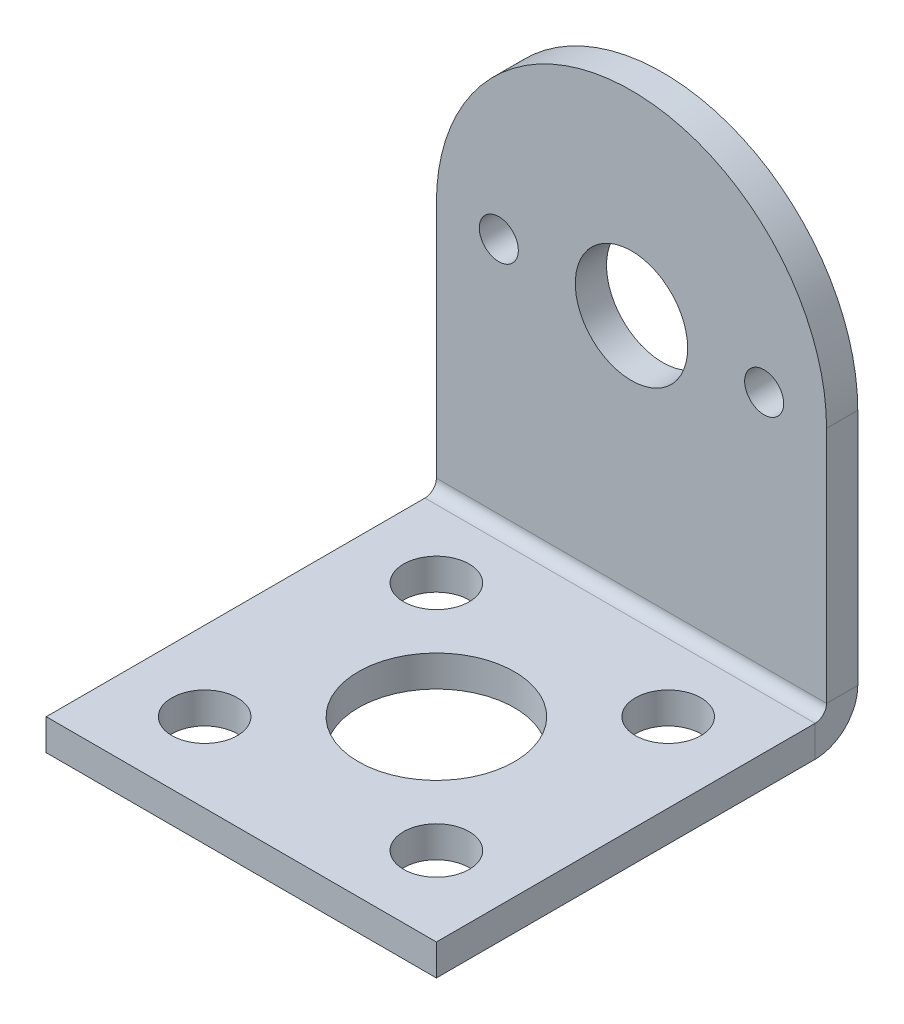
ISO-10303-21;
HEADER;
FILE_DESCRIPTION(('STEP AP214'),'2;1');
FILE_NAME('part.step','',(''),(''),'','','');
FILE_SCHEMA(('AUTOMOTIVE_DESIGN { 1 0 10303 214 1 1 1 1 }'));
ENDSEC;
DATA;
#1=APPLICATION_CONTEXT('core data for automotive mechanical design processes');
#2=APPLICATION_PROTOCOL_DEFINITION('international standard','automotive_design',2000,#1);
#3=PRODUCT_CONTEXT('',#1,'mechanical');
#4=PRODUCT('Part','Part','',(#3));
#5=PRODUCT_RELATED_PRODUCT_CATEGORY('part','',(#4));
#6=PRODUCT_DEFINITION_FORMATION('','',#4);
#7=PRODUCT_DEFINITION_CONTEXT('part definition',#1,'design');
#8=PRODUCT_DEFINITION('design','',#6,#7);
#9=PRODUCT_DEFINITION_SHAPE('','',#8);
#10=(LENGTH_UNIT() NAMED_UNIT(*) SI_UNIT(.MILLI.,.METRE.));
#11=(NAMED_UNIT(*) PLANE_ANGLE_UNIT() SI_UNIT($,.RADIAN.));
#12=(NAMED_UNIT(*) SI_UNIT($,.STERADIAN.) SOLID_ANGLE_UNIT());
#13=UNCERTAINTY_MEASURE_WITH_UNIT(LENGTH_MEASURE(1.E-05),#10,'distance_accuracy_value','');
#14=(GEOMETRIC_REPRESENTATION_CONTEXT(3) GLOBAL_UNCERTAINTY_ASSIGNED_CONTEXT((#13)) GLOBAL_UNIT_ASSIGNED_CONTEXT((#10,
#11,#12)) REPRESENTATION_CONTEXT('',''));
#15=CARTESIAN_POINT('',(0.,0.,0.));
#16=DIRECTION('',(0.,0.,1.));
#17=DIRECTION('',(1.,0.,0.));
#18=AXIS2_PLACEMENT_3D('',#15,#16,#17);
#19=CARTESIAN_POINT('',(12.5,0.,-2.));
#20=DIRECTION('',(1.,0.,0.));
#21=DIRECTION('',(0.,0.,-1.));
#22=AXIS2_PLACEMENT_3D('',#19,#20,#21);
#23=PLANE('',#22);
#24=DIRECTION('',(0.,1.,0.));
#25=VECTOR('',#24,1.);
#26=CARTESIAN_POINT('',(12.5,0.,0.));
#27=LINE('',#26,#25);
#28=CARTESIAN_POINT('',(12.5,2.7366,0.));
#29=VERTEX_POINT('',#28);
#30=CARTESIAN_POINT('',(12.5,18.,0.));
#31=VERTEX_POINT('',#30);
#32=EDGE_CURVE('E119',#29,#31,#27,.T.);
#33=ORIENTED_EDGE('',*,*,#32,.F.);
#34=DIRECTION('',(0.,0.,-1.));
#35=VECTOR('',#34,1.);
#36=CARTESIAN_POINT('',(12.5,2.7366,0.));
#37=LINE('',#36,#35);
#38=CARTESIAN_POINT('',(12.5,2.7366,-2.));
#39=VERTEX_POINT('',#38);
#40=EDGE_CURVE('E150',#29,#39,#37,.T.);
#41=ORIENTED_EDGE('',*,*,#40,.T.);
#42=DIRECTION('',(0.,1.,0.));
#43=VECTOR('',#42,1.);
#44=CARTESIAN_POINT('',(12.5,0.,-2.));
#45=LINE('',#44,#43);
#46=CARTESIAN_POINT('',(12.5,18.,-2.));
#47=VERTEX_POINT('',#46);
#48=EDGE_CURVE('E127',#39,#47,#45,.T.);
#49=ORIENTED_EDGE('',*,*,#48,.T.);
#50=DIRECTION('',(0.,0.,1.));
#51=VECTOR('',#50,1.);
#52=CARTESIAN_POINT('',(12.5,18.,-2.));
#53=LINE('',#52,#51);
#54=EDGE_CURVE('E75',#47,#31,#53,.T.);
#55=ORIENTED_EDGE('',*,*,#54,.T.);
#56=EDGE_LOOP('',(#33,#41,#49,#55));
#57=FACE_BOUND('',#56,.T.);
#58=ADVANCED_FACE('F71',(#57),#23,.T.);
#59=CARTESIAN_POINT('',(0.,18.,-2.));
#60=DIRECTION('',(0.,0.,-1.));
#61=DIRECTION('',(-1.,0.,0.));
#62=AXIS2_PLACEMENT_3D('',#59,#60,#61);
#63=PLANE('',#62);
#64=CARTESIAN_POINT('',(8.5,18.,-2.));
#65=DIRECTION('',(0.,0.,1.));
#66=DIRECTION('',(-1.,0.,0.));
#67=AXIS2_PLACEMENT_3D('',#64,#65,#66);
#68=CIRCLE('',#67,1.25);
#69=CARTESIAN_POINT('',(7.25,18.,-2.));
#70=VERTEX_POINT('',#69);
#71=EDGE_CURVE('E142',#70,#70,#68,.T.);
#72=ORIENTED_EDGE('',*,*,#71,.T.);
#73=EDGE_LOOP('',(#72));
#74=FACE_BOUND('',#73,.T.);
#75=CARTESIAN_POINT('',(-8.5,18.,-2.));
#76=DIRECTION('',(0.,0.,1.));
#77=DIRECTION('',(1.,0.,0.));
#78=AXIS2_PLACEMENT_3D('',#75,#76,#77);
#79=CIRCLE('',#78,1.25);
#80=CARTESIAN_POINT('',(-7.25,18.,-2.));
#81=VERTEX_POINT('',#80);
#82=EDGE_CURVE('E136',#81,#81,#79,.T.);
#83=ORIENTED_EDGE('',*,*,#82,.T.);
#84=EDGE_LOOP('',(#83));
#85=FACE_BOUND('',#84,.T.);
#86=CARTESIAN_POINT('',(0.,18.,-2.));
#87=DIRECTION('',(0.,0.,1.));
#88=DIRECTION('',(1.,0.,0.));
#89=AXIS2_PLACEMENT_3D('',#86,#87,#88);
#90=CIRCLE('',#89,3.6);
#91=CARTESIAN_POINT('',(3.6,18.,-2.));
#92=VERTEX_POINT('',#91);
#93=EDGE_CURVE('E120',#92,#92,#90,.T.);
#94=ORIENTED_EDGE('',*,*,#93,.T.);
#95=EDGE_LOOP('',(#94));
#96=FACE_BOUND('',#95,.T.);
#97=ORIENTED_EDGE('',*,*,#48,.F.);
#98=DIRECTION('',(1.,0.,0.));
#99=VECTOR('',#98,1.);
#100=CARTESIAN_POINT('',(12.5,2.7366,-2.));
#101=LINE('',#100,#99);
#102=CARTESIAN_POINT('',(-12.5,2.73660000000001,-2.));
#103=VERTEX_POINT('',#102);
#104=EDGE_CURVE('E167',#39,#103,#101,.F.);
#105=ORIENTED_EDGE('',*,*,#104,.T.);
#106=DIRECTION('',(0.,-1.,0.));
#107=VECTOR('',#106,1.);
#108=CARTESIAN_POINT('',(-12.5,0.,-2.));
#109=LINE('',#108,#107);
#110=CARTESIAN_POINT('',(-12.5,18.,-2.));
#111=VERTEX_POINT('',#110);
#112=EDGE_CURVE('E125',#111,#103,#109,.T.);
#113=ORIENTED_EDGE('',*,*,#112,.F.);
#114=CARTESIAN_POINT('',(0.,18.,-2.));
#115=DIRECTION('',(0.,0.,1.));
#116=DIRECTION('',(-1.,0.,0.));
#117=AXIS2_PLACEMENT_3D('',#114,#115,#116);
#118=CIRCLE('',#117,12.5);
#119=EDGE_CURVE('E111',#47,#111,#118,.T.);
#120=ORIENTED_EDGE('',*,*,#119,.F.);
#121=EDGE_LOOP('',(#97,#105,#113,#120));
#122=FACE_BOUND('',#121,.T.);
#123=ADVANCED_FACE('F287',(#74,#85,#96,#122),#63,.T.);
#124=CARTESIAN_POINT('',(0.,18.,0.));
#125=DIRECTION('',(0.,0.,-1.));
#126=DIRECTION('',(-1.,0.,0.));
#127=AXIS2_PLACEMENT_3D('',#124,#125,#126);
#128=PLANE('',#127);
#129=CARTESIAN_POINT('',(0.,18.,0.));
#130=DIRECTION('',(0.,0.,1.));
#131=DIRECTION('',(1.,0.,0.));
#132=AXIS2_PLACEMENT_3D('',#129,#130,#131);
#133=CIRCLE('',#132,3.6);
#134=CARTESIAN_POINT('',(3.6,18.,0.));
#135=VERTEX_POINT('',#134);
#136=EDGE_CURVE('E133',#135,#135,#133,.T.);
#137=ORIENTED_EDGE('',*,*,#136,.F.);
#138=EDGE_LOOP('',(#137));
#139=FACE_BOUND('',#138,.T.);
#140=CARTESIAN_POINT('',(-8.5,18.,0.));
#141=DIRECTION('',(0.,0.,1.));
#142=DIRECTION('',(1.,0.,0.));
#143=AXIS2_PLACEMENT_3D('',#140,#141,#142);
#144=CIRCLE('',#143,1.25);
#145=CARTESIAN_POINT('',(-7.25,18.,0.));
#146=VERTEX_POINT('',#145);
#147=EDGE_CURVE('E139',#146,#146,#144,.T.);
#148=ORIENTED_EDGE('',*,*,#147,.F.);
#149=EDGE_LOOP('',(#148));
#150=FACE_BOUND('',#149,.T.);
#151=CARTESIAN_POINT('',(8.5,18.,0.));
#152=DIRECTION('',(0.,0.,1.));
#153=DIRECTION('',(-1.,0.,0.));
#154=AXIS2_PLACEMENT_3D('',#151,#152,#153);
#155=CIRCLE('',#154,1.25);
#156=CARTESIAN_POINT('',(7.25,18.,0.));
#157=VERTEX_POINT('',#156);
#158=EDGE_CURVE('E145',#157,#157,#155,.T.);
#159=ORIENTED_EDGE('',*,*,#158,.F.);
#160=EDGE_LOOP('',(#159));
#161=FACE_BOUND('',#160,.T.);
#162=DIRECTION('',(1.,0.,0.));
#163=VECTOR('',#162,1.);
#164=CARTESIAN_POINT('',(12.5,2.7366,0.));
#165=LINE('',#164,#163);
#166=CARTESIAN_POINT('',(-12.5,2.7366,0.));
#167=VERTEX_POINT('',#166);
#168=EDGE_CURVE('E157',#29,#167,#165,.F.);
#169=ORIENTED_EDGE('',*,*,#168,.F.);
#170=ORIENTED_EDGE('',*,*,#32,.T.);
#171=CARTESIAN_POINT('',(0.,18.,0.));
#172=DIRECTION('',(0.,0.,1.));
#173=DIRECTION('',(-1.,0.,0.));
#174=AXIS2_PLACEMENT_3D('',#171,#172,#173);
#175=CIRCLE('',#174,12.5);
#176=CARTESIAN_POINT('',(-12.5,18.,0.));
#177=VERTEX_POINT('',#176);
#178=EDGE_CURVE('E109',#31,#177,#175,.T.);
#179=ORIENTED_EDGE('',*,*,#178,.T.);
#180=DIRECTION('',(0.,-1.,0.));
#181=VECTOR('',#180,1.);
#182=CARTESIAN_POINT('',(-12.5,0.,0.));
#183=LINE('',#182,#181);
#184=EDGE_CURVE('E114',#177,#167,#183,.T.);
#185=ORIENTED_EDGE('',*,*,#184,.T.);
#186=EDGE_LOOP('',(#169,#170,#179,#185));
#187=FACE_BOUND('',#186,.T.);
#188=ADVANCED_FACE('F122',(#139,#150,#161,#187),#128,.F.);
#189=CARTESIAN_POINT('',(-12.5,0.,-2.));
#190=DIRECTION('',(-1.,0.,0.));
#191=DIRECTION('',(0.,0.,1.));
#192=AXIS2_PLACEMENT_3D('',#189,#190,#191);
#193=PLANE('',#192);
#194=DIRECTION('',(0.,0.,-1.));
#195=VECTOR('',#194,1.);
#196=CARTESIAN_POINT('',(-12.5,2.7366,0.));
#197=LINE('',#196,#195);
#198=EDGE_CURVE('E116',#167,#103,#197,.T.);
#199=ORIENTED_EDGE('',*,*,#198,.F.);
#200=ORIENTED_EDGE('',*,*,#184,.F.);
#201=DIRECTION('',(0.,0.,1.));
#202=VECTOR('',#201,1.);
#203=CARTESIAN_POINT('',(-12.5,18.,-2.));
#204=LINE('',#203,#202);
#205=EDGE_CURVE('E13',#111,#177,#204,.T.);
#206=ORIENTED_EDGE('',*,*,#205,.F.);
#207=ORIENTED_EDGE('',*,*,#112,.T.);
#208=EDGE_LOOP('',(#199,#200,#206,#207));
#209=FACE_BOUND('',#208,.T.);
#210=ADVANCED_FACE('F73',(#209),#193,.T.);
#211=CARTESIAN_POINT('',(0.,18.,-2.));
#212=DIRECTION('',(0.,0.,1.));
#213=DIRECTION('',(1.,0.,0.));
#214=AXIS2_PLACEMENT_3D('',#211,#212,#213);
#215=CYLINDRICAL_SURFACE('',#214,12.5);
#216=ORIENTED_EDGE('',*,*,#178,.F.);
#217=ORIENTED_EDGE('',*,*,#54,.F.);
#218=ORIENTED_EDGE('',*,*,#119,.T.);
#219=ORIENTED_EDGE('',*,*,#205,.T.);
#220=EDGE_LOOP('',(#216,#217,#218,#219));
#221=FACE_BOUND('',#220,.T.);
#222=ADVANCED_FACE('F106',(#221),#215,.T.);
#223=CARTESIAN_POINT('',(0.,18.,-2.));
#224=DIRECTION('',(0.,0.,1.));
#225=DIRECTION('',(1.,0.,0.));
#226=AXIS2_PLACEMENT_3D('',#223,#224,#225);
#227=CYLINDRICAL_SURFACE('',#226,3.6);
#228=ORIENTED_EDGE('',*,*,#93,.F.);
#229=EDGE_LOOP('',(#228));
#230=FACE_BOUND('',#229,.T.);
#231=ORIENTED_EDGE('',*,*,#136,.T.);
#232=EDGE_LOOP('',(#231));
#233=FACE_BOUND('',#232,.T.);
#234=ADVANCED_FACE('F311',(#230,#233),#227,.F.);
#235=CARTESIAN_POINT('',(-8.5,18.,-2.));
#236=DIRECTION('',(0.,0.,1.));
#237=DIRECTION('',(1.,0.,0.));
#238=AXIS2_PLACEMENT_3D('',#235,#236,#237);
#239=CYLINDRICAL_SURFACE('',#238,1.25);
#240=ORIENTED_EDGE('',*,*,#82,.F.);
#241=EDGE_LOOP('',(#240));
#242=FACE_BOUND('',#241,.T.);
#243=ORIENTED_EDGE('',*,*,#147,.T.);
#244=EDGE_LOOP('',(#243));
#245=FACE_BOUND('',#244,.T.);
#246=ADVANCED_FACE('F298',(#242,#245),#239,.F.);
#247=CARTESIAN_POINT('',(8.5,18.,-2.));
#248=DIRECTION('',(0.,0.,1.));
#249=DIRECTION('',(1.,0.,0.));
#250=AXIS2_PLACEMENT_3D('',#247,#248,#249);
#251=CYLINDRICAL_SURFACE('',#250,1.25);
#252=ORIENTED_EDGE('',*,*,#71,.F.);
#253=EDGE_LOOP('',(#252));
#254=FACE_BOUND('',#253,.T.);
#255=ORIENTED_EDGE('',*,*,#158,.T.);
#256=EDGE_LOOP('',(#255));
#257=FACE_BOUND('',#256,.T.);
#258=ADVANCED_FACE('F291',(#254,#257),#251,.F.);
#259=CARTESIAN_POINT('',(-12.5,2.7366,0.7366));
#260=DIRECTION('',(-1.,0.,0.));
#261=DIRECTION('',(0.,0.,1.));
#262=AXIS2_PLACEMENT_3D('',#259,#260,#261);
#263=PLANE('',#262);
#264=DIRECTION('',(0.,1.,0.));
#265=VECTOR('',#264,1.);
#266=CARTESIAN_POINT('',(-12.5,0.,0.73659999999999));
#267=LINE('',#266,#265);
#268=CARTESIAN_POINT('',(-12.5,2.,0.736599999999997));
#269=VERTEX_POINT('',#268);
#270=CARTESIAN_POINT('',(-12.5,0.,0.73659999999999));
#271=VERTEX_POINT('',#270);
#272=EDGE_CURVE('E171',#269,#271,#267,.F.);
#273=ORIENTED_EDGE('',*,*,#272,.F.);
#274=CARTESIAN_POINT('',(-12.5,2.7366,0.7366));
#275=DIRECTION('',(1.,0.,0.));
#276=DIRECTION('',(0.,0.,-1.));
#277=AXIS2_PLACEMENT_3D('',#274,#275,#276);
#278=CIRCLE('',#277,0.7366);
#279=EDGE_CURVE('E161',#167,#269,#278,.F.);
#280=ORIENTED_EDGE('',*,*,#279,.F.);
#281=ORIENTED_EDGE('',*,*,#198,.T.);
#282=CARTESIAN_POINT('',(-12.5,2.7366,0.7366));
#283=DIRECTION('',(1.,0.,0.));
#284=DIRECTION('',(0.,0.,-1.));
#285=AXIS2_PLACEMENT_3D('',#282,#283,#284);
#286=CIRCLE('',#285,2.7366);
#287=EDGE_CURVE('E86',#103,#271,#286,.F.);
#288=ORIENTED_EDGE('',*,*,#287,.T.);
#289=EDGE_LOOP('',(#273,#280,#281,#288));
#290=FACE_BOUND('',#289,.T.);
#291=ADVANCED_FACE('F289',(#290),#263,.T.);
#292=CARTESIAN_POINT('',(12.5,2.7366,0.7366));
#293=DIRECTION('',(-1.,0.,0.));
#294=DIRECTION('',(0.,0.,1.));
#295=AXIS2_PLACEMENT_3D('',#292,#293,#294);
#296=PLANE('',#295);
#297=CARTESIAN_POINT('',(12.5,2.7366,0.7366));
#298=DIRECTION('',(1.,0.,0.));
#299=DIRECTION('',(0.,0.,-1.));
#300=AXIS2_PLACEMENT_3D('',#297,#298,#299);
#301=CIRCLE('',#300,0.7366);
#302=CARTESIAN_POINT('',(12.5,2.,0.736599999999997));
#303=VERTEX_POINT('',#302);
#304=EDGE_CURVE('E154',#303,#29,#301,.T.);
#305=ORIENTED_EDGE('',*,*,#304,.F.);
#306=DIRECTION('',(0.,1.,0.));
#307=VECTOR('',#306,1.);
#308=CARTESIAN_POINT('',(12.5,2.,0.736599999999997));
#309=LINE('',#308,#307);
#310=CARTESIAN_POINT('',(12.5,0.,0.73659999999999));
#311=VERTEX_POINT('',#310);
#312=EDGE_CURVE('E177',#303,#311,#309,.F.);
#313=ORIENTED_EDGE('',*,*,#312,.T.);
#314=CARTESIAN_POINT('',(12.5,2.7366,0.7366));
#315=DIRECTION('',(1.,0.,0.));
#316=DIRECTION('',(0.,0.,-1.));
#317=AXIS2_PLACEMENT_3D('',#314,#315,#316);
#318=CIRCLE('',#317,2.7366);
#319=EDGE_CURVE('E164',#311,#39,#318,.T.);
#320=ORIENTED_EDGE('',*,*,#319,.T.);
#321=ORIENTED_EDGE('',*,*,#40,.F.);
#322=EDGE_LOOP('',(#305,#313,#320,#321));
#323=FACE_BOUND('',#322,.T.);
#324=ADVANCED_FACE('F281',(#323),#296,.F.);
#325=CARTESIAN_POINT('',(12.5,2.7366,0.7366));
#326=DIRECTION('',(1.,0.,0.));
#327=DIRECTION('',(0.,-1.,0.));
#328=AXIS2_PLACEMENT_3D('',#325,#326,#327);
#329=CYLINDRICAL_SURFACE('',#328,2.7366);
#330=ORIENTED_EDGE('',*,*,#104,.F.);
#331=ORIENTED_EDGE('',*,*,#319,.F.);
#332=DIRECTION('',(1.,0.,0.));
#333=VECTOR('',#332,1.);
#334=CARTESIAN_POINT('',(-12.5,0.,0.73659999999999));
#335=LINE('',#334,#333);
#336=EDGE_CURVE('E180',#311,#271,#335,.F.);
#337=ORIENTED_EDGE('',*,*,#336,.T.);
#338=ORIENTED_EDGE('',*,*,#287,.F.);
#339=EDGE_LOOP('',(#330,#331,#337,#338));
#340=FACE_BOUND('',#339,.T.);
#341=ADVANCED_FACE('F288',(#340),#329,.T.);
#342=CARTESIAN_POINT('',(12.5,2.7366,0.7366));
#343=DIRECTION('',(1.,0.,0.));
#344=DIRECTION('',(0.,-1.,0.));
#345=AXIS2_PLACEMENT_3D('',#342,#343,#344);
#346=CYLINDRICAL_SURFACE('',#345,0.7366);
#347=ORIENTED_EDGE('',*,*,#168,.T.);
#348=ORIENTED_EDGE('',*,*,#279,.T.);
#349=DIRECTION('',(1.,0.,0.));
#350=VECTOR('',#349,1.);
#351=CARTESIAN_POINT('',(-12.5,2.,0.736599999999997));
#352=LINE('',#351,#350);
#353=EDGE_CURVE('E174',#269,#303,#352,.T.);
#354=ORIENTED_EDGE('',*,*,#353,.T.);
#355=ORIENTED_EDGE('',*,*,#304,.T.);
#356=EDGE_LOOP('',(#347,#348,#354,#355));
#357=FACE_BOUND('',#356,.T.);
#358=ADVANCED_FACE('F283',(#357),#346,.F.);
#359=CARTESIAN_POINT('',(0.,0.,0.));
#360=DIRECTION('',(0.,1.,0.));
#361=DIRECTION('',(0.,0.,1.));
#362=AXIS2_PLACEMENT_3D('',#359,#360,#361);
#363=PLANE('',#362);
#364=CARTESIAN_POINT('',(7.425,0.,19.925));
#365=DIRECTION('',(0.,1.,0.));
#366=DIRECTION('',(0.,0.,1.));
#367=AXIS2_PLACEMENT_3D('',#364,#365,#366);
#368=CIRCLE('',#367,2.1);
#369=CARTESIAN_POINT('',(7.425,0.,22.025));
#370=VERTEX_POINT('',#369);
#371=EDGE_CURVE('E185',#370,#370,#368,.F.);
#372=ORIENTED_EDGE('',*,*,#371,.F.);
#373=EDGE_LOOP('',(#372));
#374=FACE_BOUND('',#373,.T.);
#375=CARTESIAN_POINT('',(7.425,0.,5.075));
#376=DIRECTION('',(0.,1.,0.));
#377=DIRECTION('',(0.,0.,1.));
#378=AXIS2_PLACEMENT_3D('',#375,#376,#377);
#379=CIRCLE('',#378,2.1);
#380=CARTESIAN_POINT('',(7.425,0.,7.175));
#381=VERTEX_POINT('',#380);
#382=EDGE_CURVE('E191',#381,#381,#379,.F.);
#383=ORIENTED_EDGE('',*,*,#382,.F.);
#384=EDGE_LOOP('',(#383));
#385=FACE_BOUND('',#384,.T.);
#386=CARTESIAN_POINT('',(-7.425,0.,19.925));
#387=DIRECTION('',(0.,1.,0.));
#388=DIRECTION('',(0.,0.,1.));
#389=AXIS2_PLACEMENT_3D('',#386,#387,#388);
#390=CIRCLE('',#389,2.1);
#391=CARTESIAN_POINT('',(-7.425,0.,22.025));
#392=VERTEX_POINT('',#391);
#393=EDGE_CURVE('E197',#392,#392,#390,.F.);
#394=ORIENTED_EDGE('',*,*,#393,.F.);
#395=EDGE_LOOP('',(#394));
#396=FACE_BOUND('',#395,.T.);
#397=CARTESIAN_POINT('',(-7.425,0.,5.07499999999999));
#398=DIRECTION('',(0.,1.,0.));
#399=DIRECTION('',(0.,0.,1.));
#400=AXIS2_PLACEMENT_3D('',#397,#398,#399);
#401=CIRCLE('',#400,2.1);
#402=CARTESIAN_POINT('',(-7.425,0.,7.17499999999999));
#403=VERTEX_POINT('',#402);
#404=EDGE_CURVE('E203',#403,#403,#401,.F.);
#405=ORIENTED_EDGE('',*,*,#404,.F.);
#406=EDGE_LOOP('',(#405));
#407=FACE_BOUND('',#406,.T.);
#408=CARTESIAN_POINT('',(0.,0.,12.5));
#409=DIRECTION('',(0.,1.,0.));
#410=DIRECTION('',(0.,0.,1.));
#411=AXIS2_PLACEMENT_3D('',#408,#409,#410);
#412=CIRCLE('',#411,5.);
#413=CARTESIAN_POINT('',(0.,0.,17.5));
#414=VERTEX_POINT('',#413);
#415=EDGE_CURVE('E209',#414,#414,#412,.F.);
#416=ORIENTED_EDGE('',*,*,#415,.F.);
#417=EDGE_LOOP('',(#416));
#418=FACE_BOUND('',#417,.T.);
#419=ORIENTED_EDGE('',*,*,#336,.F.);
#420=DIRECTION('',(0.,0.,1.));
#421=VECTOR('',#420,1.);
#422=CARTESIAN_POINT('',(12.5,0.,0.));
#423=LINE('',#422,#421);
#424=CARTESIAN_POINT('',(12.5,0.,25.));
#425=VERTEX_POINT('',#424);
#426=EDGE_CURVE('E224',#311,#425,#423,.T.);
#427=ORIENTED_EDGE('',*,*,#426,.T.);
#428=DIRECTION('',(-1.,0.,0.));
#429=VECTOR('',#428,1.);
#430=CARTESIAN_POINT('',(0.,0.,25.));
#431=LINE('',#430,#429);
#432=CARTESIAN_POINT('',(-12.5,0.,25.));
#433=VERTEX_POINT('',#432);
#434=EDGE_CURVE('E227',#425,#433,#431,.T.);
#435=ORIENTED_EDGE('',*,*,#434,.T.);
#436=DIRECTION('',(0.,0.,-1.));
#437=VECTOR('',#436,1.);
#438=CARTESIAN_POINT('',(-12.5,0.,0.));
#439=LINE('',#438,#437);
#440=EDGE_CURVE('E221',#433,#271,#439,.T.);
#441=ORIENTED_EDGE('',*,*,#440,.T.);
#442=EDGE_LOOP('',(#419,#427,#435,#441));
#443=FACE_BOUND('',#442,.T.);
#444=ADVANCED_FACE('F276',(#374,#385,#396,#407,#418,#443),#363,.F.);
#445=CARTESIAN_POINT('',(0.,2.,0.));
#446=DIRECTION('',(0.,1.,0.));
#447=DIRECTION('',(0.,0.,1.));
#448=AXIS2_PLACEMENT_3D('',#445,#446,#447);
#449=PLANE('',#448);
#450=CARTESIAN_POINT('',(7.425,1.99999999999998,5.075));
#451=DIRECTION('',(0.,1.,0.));
#452=DIRECTION('',(0.,0.,1.));
#453=AXIS2_PLACEMENT_3D('',#450,#451,#452);
#454=CIRCLE('',#453,2.1);
#455=CARTESIAN_POINT('',(7.425,1.99999999999997,7.175));
#456=VERTEX_POINT('',#455);
#457=EDGE_CURVE('E188',#456,#456,#454,.F.);
#458=ORIENTED_EDGE('',*,*,#457,.T.);
#459=EDGE_LOOP('',(#458));
#460=FACE_BOUND('',#459,.T.);
#461=CARTESIAN_POINT('',(-7.425,1.99999999999998,5.075));
#462=DIRECTION('',(0.,1.,0.));
#463=DIRECTION('',(0.,0.,1.));
#464=AXIS2_PLACEMENT_3D('',#461,#462,#463);
#465=CIRCLE('',#464,2.1);
#466=CARTESIAN_POINT('',(-7.425,1.99999999999997,7.175));
#467=VERTEX_POINT('',#466);
#468=EDGE_CURVE('E200',#467,#467,#465,.F.);
#469=ORIENTED_EDGE('',*,*,#468,.T.);
#470=EDGE_LOOP('',(#469));
#471=FACE_BOUND('',#470,.T.);
#472=CARTESIAN_POINT('',(0.,1.99999999999996,12.5));
#473=DIRECTION('',(0.,1.,0.));
#474=DIRECTION('',(0.,0.,1.));
#475=AXIS2_PLACEMENT_3D('',#472,#473,#474);
#476=CIRCLE('',#475,5.);
#477=CARTESIAN_POINT('',(0.,1.99999999999994,17.5));
#478=VERTEX_POINT('',#477);
#479=EDGE_CURVE('E206',#478,#478,#476,.F.);
#480=ORIENTED_EDGE('',*,*,#479,.T.);
#481=EDGE_LOOP('',(#480));
#482=FACE_BOUND('',#481,.T.);
#483=CARTESIAN_POINT('',(-7.425,1.99999999999993,19.925));
#484=DIRECTION('',(0.,1.,0.));
#485=DIRECTION('',(0.,0.,1.));
#486=AXIS2_PLACEMENT_3D('',#483,#484,#485);
#487=CIRCLE('',#486,2.1);
#488=CARTESIAN_POINT('',(-7.425,1.99999999999992,22.025));
#489=VERTEX_POINT('',#488);
#490=EDGE_CURVE('E194',#489,#489,#487,.F.);
#491=ORIENTED_EDGE('',*,*,#490,.T.);
#492=EDGE_LOOP('',(#491));
#493=FACE_BOUND('',#492,.T.);
#494=CARTESIAN_POINT('',(7.425,1.99999999999993,19.925));
#495=DIRECTION('',(0.,1.,0.));
#496=DIRECTION('',(0.,0.,1.));
#497=AXIS2_PLACEMENT_3D('',#494,#495,#496);
#498=CIRCLE('',#497,2.1);
#499=CARTESIAN_POINT('',(7.425,1.99999999999992,22.025));
#500=VERTEX_POINT('',#499);
#501=EDGE_CURVE('E182',#500,#500,#498,.F.);
#502=ORIENTED_EDGE('',*,*,#501,.T.);
#503=EDGE_LOOP('',(#502));
#504=FACE_BOUND('',#503,.T.);
#505=DIRECTION('',(0.,0.,-1.));
#506=VECTOR('',#505,1.);
#507=CARTESIAN_POINT('',(12.5,1.99999999999991,25.));
#508=LINE('',#507,#506);
#509=CARTESIAN_POINT('',(12.5,1.99999999999991,25.));
#510=VERTEX_POINT('',#509);
#511=EDGE_CURVE('E215',#303,#510,#508,.F.);
#512=ORIENTED_EDGE('',*,*,#511,.F.);
#513=ORIENTED_EDGE('',*,*,#353,.F.);
#514=DIRECTION('',(0.,0.,1.));
#515=VECTOR('',#514,1.);
#516=CARTESIAN_POINT('',(-12.5,2.,0.));
#517=LINE('',#516,#515);
#518=CARTESIAN_POINT('',(-12.5,1.99999999999991,25.));
#519=VERTEX_POINT('',#518);
#520=EDGE_CURVE('E212',#519,#269,#517,.F.);
#521=ORIENTED_EDGE('',*,*,#520,.F.);
#522=DIRECTION('',(1.,0.,0.));
#523=VECTOR('',#522,1.);
#524=CARTESIAN_POINT('',(-12.5,1.99999999999991,25.));
#525=LINE('',#524,#523);
#526=EDGE_CURVE('E218',#510,#519,#525,.F.);
#527=ORIENTED_EDGE('',*,*,#526,.F.);
#528=EDGE_LOOP('',(#512,#513,#521,#527));
#529=FACE_BOUND('',#528,.T.);
#530=ADVANCED_FACE('F250',(#460,#471,#482,#493,#504,#529),#449,.T.);
#531=CARTESIAN_POINT('',(-12.5,0.,0.));
#532=DIRECTION('',(1.,0.,0.));
#533=DIRECTION('',(0.,0.,-1.));
#534=AXIS2_PLACEMENT_3D('',#531,#532,#533);
#535=PLANE('',#534);
#536=ORIENTED_EDGE('',*,*,#272,.T.);
#537=ORIENTED_EDGE('',*,*,#440,.F.);
#538=DIRECTION('',(0.,1.,0.));
#539=VECTOR('',#538,1.);
#540=CARTESIAN_POINT('',(-12.5,0.,25.));
#541=LINE('',#540,#539);
#542=EDGE_CURVE('E230',#433,#519,#541,.T.);
#543=ORIENTED_EDGE('',*,*,#542,.T.);
#544=ORIENTED_EDGE('',*,*,#520,.T.);
#545=EDGE_LOOP('',(#536,#537,#543,#544));
#546=FACE_BOUND('',#545,.T.);
#547=ADVANCED_FACE('F256',(#546),#535,.F.);
#548=CARTESIAN_POINT('',(12.5,0.,25.));
#549=DIRECTION('',(-1.,0.,0.));
#550=DIRECTION('',(0.,0.,1.));
#551=AXIS2_PLACEMENT_3D('',#548,#549,#550);
#552=PLANE('',#551);
#553=ORIENTED_EDGE('',*,*,#312,.F.);
#554=ORIENTED_EDGE('',*,*,#511,.T.);
#555=DIRECTION('',(0.,1.,0.));
#556=VECTOR('',#555,1.);
#557=CARTESIAN_POINT('',(12.5,0.,25.));
#558=LINE('',#557,#556);
#559=EDGE_CURVE('E158',#425,#510,#558,.T.);
#560=ORIENTED_EDGE('',*,*,#559,.F.);
#561=ORIENTED_EDGE('',*,*,#426,.F.);
#562=EDGE_LOOP('',(#553,#554,#560,#561));
#563=FACE_BOUND('',#562,.T.);
#564=ADVANCED_FACE('F278',(#563),#552,.F.);
#565=CARTESIAN_POINT('',(-12.5,0.,25.));
#566=DIRECTION('',(0.,0.,-1.));
#567=DIRECTION('',(0.,1.,0.));
#568=AXIS2_PLACEMENT_3D('',#565,#566,#567);
#569=PLANE('',#568);
#570=ORIENTED_EDGE('',*,*,#526,.T.);
#571=ORIENTED_EDGE('',*,*,#542,.F.);
#572=ORIENTED_EDGE('',*,*,#434,.F.);
#573=ORIENTED_EDGE('',*,*,#559,.T.);
#574=EDGE_LOOP('',(#570,#571,#572,#573));
#575=FACE_BOUND('',#574,.T.);
#576=ADVANCED_FACE('F239',(#575),#569,.F.);
#577=CARTESIAN_POINT('',(0.,0.,12.5));
#578=DIRECTION('',(0.,1.,0.));
#579=DIRECTION('',(0.,0.,1.));
#580=AXIS2_PLACEMENT_3D('',#577,#578,#579);
#581=CYLINDRICAL_SURFACE('',#580,5.);
#582=ORIENTED_EDGE('',*,*,#415,.T.);
#583=EDGE_LOOP('',(#582));
#584=FACE_BOUND('',#583,.T.);
#585=ORIENTED_EDGE('',*,*,#479,.F.);
#586=EDGE_LOOP('',(#585));
#587=FACE_BOUND('',#586,.T.);
#588=ADVANCED_FACE('F446',(#584,#587),#581,.F.);
#589=CARTESIAN_POINT('',(-7.425,0.,5.07499999999999));
#590=DIRECTION('',(0.,1.,0.));
#591=DIRECTION('',(0.,0.,1.));
#592=AXIS2_PLACEMENT_3D('',#589,#590,#591);
#593=CYLINDRICAL_SURFACE('',#592,2.1);
#594=ORIENTED_EDGE('',*,*,#404,.T.);
#595=EDGE_LOOP('',(#594));
#596=FACE_BOUND('',#595,.T.);
#597=ORIENTED_EDGE('',*,*,#468,.F.);
#598=EDGE_LOOP('',(#597));
#599=FACE_BOUND('',#598,.T.);
#600=ADVANCED_FACE('F456',(#596,#599),#593,.F.);
#601=CARTESIAN_POINT('',(-7.425,0.,19.925));
#602=DIRECTION('',(0.,1.,0.));
#603=DIRECTION('',(0.,0.,1.));
#604=AXIS2_PLACEMENT_3D('',#601,#602,#603);
#605=CYLINDRICAL_SURFACE('',#604,2.1);
#606=ORIENTED_EDGE('',*,*,#393,.T.);
#607=EDGE_LOOP('',(#606));
#608=FACE_BOUND('',#607,.T.);
#609=ORIENTED_EDGE('',*,*,#490,.F.);
#610=EDGE_LOOP('',(#609));
#611=FACE_BOUND('',#610,.T.);
#612=ADVANCED_FACE('F467',(#608,#611),#605,.F.);
#613=CARTESIAN_POINT('',(7.425,0.,5.075));
#614=DIRECTION('',(0.,1.,0.));
#615=DIRECTION('',(0.,0.,1.));
#616=AXIS2_PLACEMENT_3D('',#613,#614,#615);
#617=CYLINDRICAL_SURFACE('',#616,2.1);
#618=ORIENTED_EDGE('',*,*,#382,.T.);
#619=EDGE_LOOP('',(#618));
#620=FACE_BOUND('',#619,.T.);
#621=ORIENTED_EDGE('',*,*,#457,.F.);
#622=EDGE_LOOP('',(#621));
#623=FACE_BOUND('',#622,.T.);
#624=ADVANCED_FACE('F478',(#620,#623),#617,.F.);
#625=CARTESIAN_POINT('',(7.425,0.,19.925));
#626=DIRECTION('',(0.,1.,0.));
#627=DIRECTION('',(0.,0.,1.));
#628=AXIS2_PLACEMENT_3D('',#625,#626,#627);
#629=CYLINDRICAL_SURFACE('',#628,2.1);
#630=ORIENTED_EDGE('',*,*,#371,.T.);
#631=EDGE_LOOP('',(#630));
#632=FACE_BOUND('',#631,.T.);
#633=ORIENTED_EDGE('',*,*,#501,.F.);
#634=EDGE_LOOP('',(#633));
#635=FACE_BOUND('',#634,.T.);
#636=ADVANCED_FACE('F489',(#632,#635),#629,.F.);
#637=CLOSED_SHELL('',(#58,#123,#188,#210,#222,#234,#246,#258,#291,#324,#341,#358,#444,#530,#547,
#564,#576,#588,#600,#612,#624,#636));
#638=MANIFOLD_SOLID_BREP('B2',#637);
#639=ADVANCED_BREP_SHAPE_REPRESENTATION('',(#18,#638),#14);
#640=SHAPE_DEFINITION_REPRESENTATION(#9,#639);
ENDSEC;
END-ISO-10303-21;
